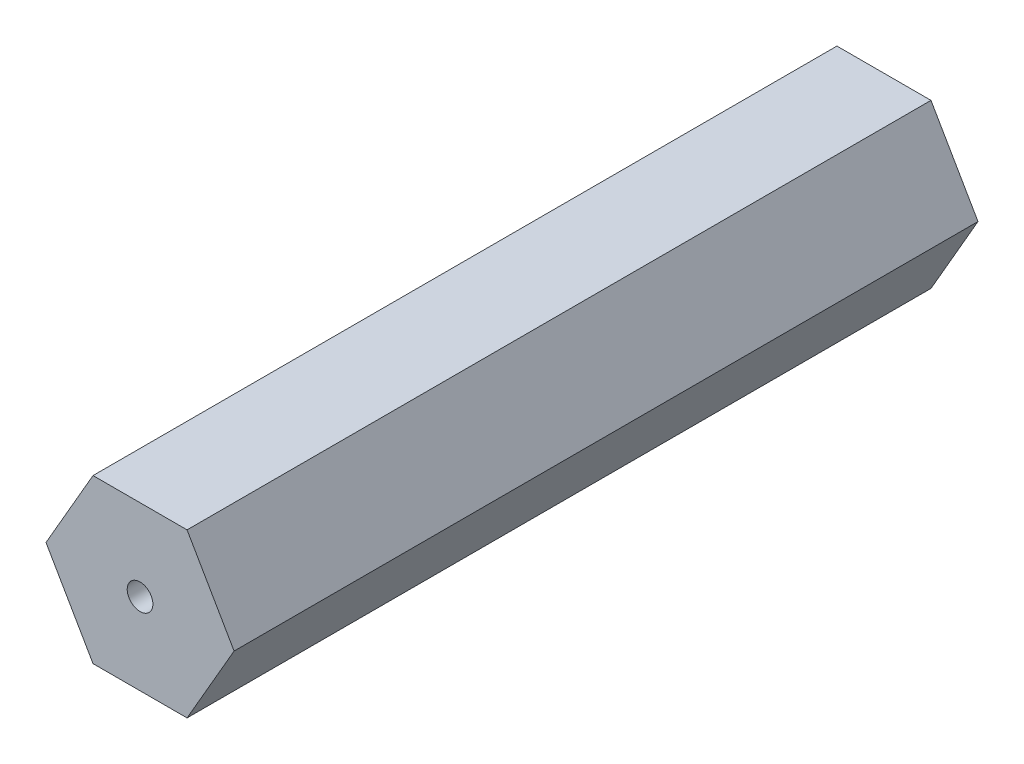
ISO-10303-21;
HEADER;
FILE_DESCRIPTION(('STEP AP214'),'2;1');
FILE_NAME('part.step','',(''),(''),'','','');
FILE_SCHEMA(('AUTOMOTIVE_DESIGN { 1 0 10303 214 1 1 1 1 }'));
ENDSEC;
DATA;
#1=APPLICATION_CONTEXT('core data for automotive mechanical design processes');
#2=APPLICATION_PROTOCOL_DEFINITION('international standard','automotive_design',2000,#1);
#3=PRODUCT_CONTEXT('',#1,'mechanical');
#4=PRODUCT('Part','Part','',(#3));
#5=PRODUCT_RELATED_PRODUCT_CATEGORY('part','',(#4));
#6=PRODUCT_DEFINITION_FORMATION('','',#4);
#7=PRODUCT_DEFINITION_CONTEXT('part definition',#1,'design');
#8=PRODUCT_DEFINITION('design','',#6,#7);
#9=PRODUCT_DEFINITION_SHAPE('','',#8);
#10=(LENGTH_UNIT() NAMED_UNIT(*) SI_UNIT(.MILLI.,.METRE.));
#11=(NAMED_UNIT(*) PLANE_ANGLE_UNIT() SI_UNIT($,.RADIAN.));
#12=(NAMED_UNIT(*) SI_UNIT($,.STERADIAN.) SOLID_ANGLE_UNIT());
#13=UNCERTAINTY_MEASURE_WITH_UNIT(LENGTH_MEASURE(1.E-05),#10,'distance_accuracy_value','');
#14=(GEOMETRIC_REPRESENTATION_CONTEXT(3) GLOBAL_UNCERTAINTY_ASSIGNED_CONTEXT((#13)) GLOBAL_UNIT_ASSIGNED_CONTEXT((#10,
#11,#12)) REPRESENTATION_CONTEXT('',''));
#15=CARTESIAN_POINT('',(0.,0.,0.));
#16=DIRECTION('',(0.,0.,1.));
#17=DIRECTION('',(1.,0.,0.));
#18=AXIS2_PLACEMENT_3D('',#15,#16,#17);
#19=CARTESIAN_POINT('',(3.66617420935419,-6.34999999999994,58.));
#20=DIRECTION('',(-0.866025403784441,0.499999999999995,0.));
#21=DIRECTION('',(-0.499999999999995,-0.866025403784442,0.));
#22=AXIS2_PLACEMENT_3D('',#19,#20,#21);
#23=PLANE('',#22);
#24=DIRECTION('',(0.499999999999995,0.866025403784442,0.));
#25=VECTOR('',#24,1.);
#26=CARTESIAN_POINT('',(3.66617420935419,-6.34999999999994,0.));
#27=LINE('',#26,#25);
#28=CARTESIAN_POINT('',(3.66617420935419,-6.34999999999994,0.));
#29=VERTEX_POINT('',#28);
#30=CARTESIAN_POINT('',(7.33234841870822,0.,0.));
#31=VERTEX_POINT('',#30);
#32=EDGE_CURVE('E122',#29,#31,#27,.T.);
#33=ORIENTED_EDGE('',*,*,#32,.T.);
#34=DIRECTION('',(0.,0.,-1.));
#35=VECTOR('',#34,1.);
#36=CARTESIAN_POINT('',(7.33234841870822,0.,58.));
#37=LINE('',#36,#35);
#38=CARTESIAN_POINT('',(7.33234841870822,0.,58.));
#39=VERTEX_POINT('',#38);
#40=EDGE_CURVE('E11',#39,#31,#37,.T.);
#41=ORIENTED_EDGE('',*,*,#40,.F.);
#42=DIRECTION('',(0.499999999999995,0.866025403784442,0.));
#43=VECTOR('',#42,1.);
#44=CARTESIAN_POINT('',(3.66617420935419,-6.34999999999994,58.));
#45=LINE('',#44,#43);
#46=CARTESIAN_POINT('',(3.66617420935419,-6.34999999999994,58.));
#47=VERTEX_POINT('',#46);
#48=EDGE_CURVE('E133',#47,#39,#45,.T.);
#49=ORIENTED_EDGE('',*,*,#48,.F.);
#50=DIRECTION('',(0.,0.,-1.));
#51=VECTOR('',#50,1.);
#52=CARTESIAN_POINT('',(3.66617420935419,-6.34999999999994,58.));
#53=LINE('',#52,#51);
#54=EDGE_CURVE('E118',#47,#29,#53,.T.);
#55=ORIENTED_EDGE('',*,*,#54,.T.);
#56=EDGE_LOOP('',(#33,#41,#49,#55));
#57=FACE_BOUND('',#56,.T.);
#58=ADVANCED_FACE('F38',(#57),#23,.F.);
#59=CARTESIAN_POINT('',(7.33234841870822,0.,58.));
#60=DIRECTION('',(-0.866025403784438,-0.500000000000001,0.));
#61=DIRECTION('',(0.500000000000001,-0.866025403784438,0.));
#62=AXIS2_PLACEMENT_3D('',#59,#60,#61);
#63=PLANE('',#62);
#64=DIRECTION('',(-0.500000000000001,0.866025403784438,0.));
#65=VECTOR('',#64,1.);
#66=CARTESIAN_POINT('',(7.33234841870822,0.,0.));
#67=LINE('',#66,#65);
#68=CARTESIAN_POINT('',(3.6661742093541,6.34999999999999,0.));
#69=VERTEX_POINT('',#68);
#70=EDGE_CURVE('E125',#31,#69,#67,.T.);
#71=ORIENTED_EDGE('',*,*,#70,.T.);
#72=DIRECTION('',(0.,0.,-1.));
#73=VECTOR('',#72,1.);
#74=CARTESIAN_POINT('',(3.6661742093541,6.34999999999999,58.));
#75=LINE('',#74,#73);
#76=CARTESIAN_POINT('',(3.6661742093541,6.34999999999999,58.));
#77=VERTEX_POINT('',#76);
#78=EDGE_CURVE('E46',#77,#69,#75,.T.);
#79=ORIENTED_EDGE('',*,*,#78,.F.);
#80=DIRECTION('',(-0.500000000000001,0.866025403784438,0.));
#81=VECTOR('',#80,1.);
#82=CARTESIAN_POINT('',(7.33234841870822,0.,58.));
#83=LINE('',#82,#81);
#84=EDGE_CURVE('E91',#39,#77,#83,.T.);
#85=ORIENTED_EDGE('',*,*,#84,.F.);
#86=ORIENTED_EDGE('',*,*,#40,.T.);
#87=EDGE_LOOP('',(#71,#79,#85,#86));
#88=FACE_BOUND('',#87,.T.);
#89=ADVANCED_FACE('F158',(#88),#63,.F.);
#90=CARTESIAN_POINT('',(3.6661742093541,6.34999999999999,58.));
#91=DIRECTION('',(0.,-1.,0.));
#92=DIRECTION('',(1.,0.,0.));
#93=AXIS2_PLACEMENT_3D('',#90,#91,#92);
#94=PLANE('',#93);
#95=DIRECTION('',(-1.,0.,0.));
#96=VECTOR('',#95,1.);
#97=CARTESIAN_POINT('',(3.6661742093541,6.34999999999999,0.));
#98=LINE('',#97,#96);
#99=CARTESIAN_POINT('',(-3.66617420935414,6.34999999999996,0.));
#100=VERTEX_POINT('',#99);
#101=EDGE_CURVE('E128',#69,#100,#98,.T.);
#102=ORIENTED_EDGE('',*,*,#101,.T.);
#103=DIRECTION('',(0.,0.,-1.));
#104=VECTOR('',#103,1.);
#105=CARTESIAN_POINT('',(-3.66617420935414,6.34999999999996,58.));
#106=LINE('',#105,#104);
#107=CARTESIAN_POINT('',(-3.66617420935414,6.34999999999996,58.));
#108=VERTEX_POINT('',#107);
#109=EDGE_CURVE('E113',#108,#100,#106,.T.);
#110=ORIENTED_EDGE('',*,*,#109,.F.);
#111=DIRECTION('',(-1.,0.,0.));
#112=VECTOR('',#111,1.);
#113=CARTESIAN_POINT('',(3.6661742093541,6.34999999999999,58.));
#114=LINE('',#113,#112);
#115=EDGE_CURVE('E104',#77,#108,#114,.T.);
#116=ORIENTED_EDGE('',*,*,#115,.F.);
#117=ORIENTED_EDGE('',*,*,#78,.T.);
#118=EDGE_LOOP('',(#102,#110,#116,#117));
#119=FACE_BOUND('',#118,.T.);
#120=ADVANCED_FACE('F139',(#119),#94,.F.);
#121=CARTESIAN_POINT('',(-3.66617420935414,6.34999999999996,58.));
#122=DIRECTION('',(0.866025403784442,-0.499999999999995,0.));
#123=DIRECTION('',(0.499999999999995,0.866025403784442,0.));
#124=AXIS2_PLACEMENT_3D('',#121,#122,#123);
#125=PLANE('',#124);
#126=DIRECTION('',(-0.499999999999995,-0.866025403784441,0.));
#127=VECTOR('',#126,1.);
#128=CARTESIAN_POINT('',(-3.66617420935414,6.34999999999996,0.));
#129=LINE('',#128,#127);
#130=CARTESIAN_POINT('',(-7.33234841870822,0.,0.));
#131=VERTEX_POINT('',#130);
#132=EDGE_CURVE('E112',#100,#131,#129,.T.);
#133=ORIENTED_EDGE('',*,*,#132,.T.);
#134=DIRECTION('',(0.,0.,-1.));
#135=VECTOR('',#134,1.);
#136=CARTESIAN_POINT('',(-7.33234841870822,0.,58.));
#137=LINE('',#136,#135);
#138=CARTESIAN_POINT('',(-7.33234841870822,0.,58.));
#139=VERTEX_POINT('',#138);
#140=EDGE_CURVE('E109',#139,#131,#137,.T.);
#141=ORIENTED_EDGE('',*,*,#140,.F.);
#142=DIRECTION('',(-0.499999999999995,-0.866025403784441,0.));
#143=VECTOR('',#142,1.);
#144=CARTESIAN_POINT('',(-3.66617420935414,6.34999999999996,58.));
#145=LINE('',#144,#143);
#146=EDGE_CURVE('E98',#108,#139,#145,.T.);
#147=ORIENTED_EDGE('',*,*,#146,.F.);
#148=ORIENTED_EDGE('',*,*,#109,.T.);
#149=EDGE_LOOP('',(#133,#141,#147,#148));
#150=FACE_BOUND('',#149,.T.);
#151=ADVANCED_FACE('F110',(#150),#125,.F.);
#152=CARTESIAN_POINT('',(-7.33234841870822,0.,58.));
#153=DIRECTION('',(0.866025403784434,0.500000000000007,0.));
#154=DIRECTION('',(-0.500000000000007,0.866025403784435,0.));
#155=AXIS2_PLACEMENT_3D('',#152,#153,#154);
#156=PLANE('',#155);
#157=DIRECTION('',(0.500000000000007,-0.866025403784434,0.));
#158=VECTOR('',#157,1.);
#159=CARTESIAN_POINT('',(-7.33234841870822,0.,0.));
#160=LINE('',#159,#158);
#161=CARTESIAN_POINT('',(-3.66617420935405,-6.35000000000001,0.));
#162=VERTEX_POINT('',#161);
#163=EDGE_CURVE('E77',#131,#162,#160,.T.);
#164=ORIENTED_EDGE('',*,*,#163,.T.);
#165=DIRECTION('',(0.,0.,-1.));
#166=VECTOR('',#165,1.);
#167=CARTESIAN_POINT('',(-3.66617420935405,-6.35000000000001,58.));
#168=LINE('',#167,#166);
#169=CARTESIAN_POINT('',(-3.66617420935405,-6.35000000000001,58.));
#170=VERTEX_POINT('',#169);
#171=EDGE_CURVE('E114',#170,#162,#168,.T.);
#172=ORIENTED_EDGE('',*,*,#171,.F.);
#173=DIRECTION('',(0.500000000000007,-0.866025403784434,0.));
#174=VECTOR('',#173,1.);
#175=CARTESIAN_POINT('',(-7.33234841870822,0.,58.));
#176=LINE('',#175,#174);
#177=EDGE_CURVE('E102',#139,#170,#176,.T.);
#178=ORIENTED_EDGE('',*,*,#177,.F.);
#179=ORIENTED_EDGE('',*,*,#140,.T.);
#180=EDGE_LOOP('',(#164,#172,#178,#179));
#181=FACE_BOUND('',#180,.T.);
#182=ADVANCED_FACE('F116',(#181),#156,.F.);
#183=CARTESIAN_POINT('',(-3.66617420935405,-6.35000000000001,58.));
#184=DIRECTION('',(0.,1.,0.));
#185=DIRECTION('',(-1.,0.,0.));
#186=AXIS2_PLACEMENT_3D('',#183,#184,#185);
#187=PLANE('',#186);
#188=DIRECTION('',(1.,0.,0.));
#189=VECTOR('',#188,1.);
#190=CARTESIAN_POINT('',(-3.66617420935405,-6.35000000000001,0.));
#191=LINE('',#190,#189);
#192=EDGE_CURVE('E83',#162,#29,#191,.T.);
#193=ORIENTED_EDGE('',*,*,#192,.T.);
#194=ORIENTED_EDGE('',*,*,#54,.F.);
#195=DIRECTION('',(1.,0.,0.));
#196=VECTOR('',#195,1.);
#197=CARTESIAN_POINT('',(-3.66617420935405,-6.35000000000001,58.));
#198=LINE('',#197,#196);
#199=EDGE_CURVE('E54',#170,#47,#198,.T.);
#200=ORIENTED_EDGE('',*,*,#199,.F.);
#201=ORIENTED_EDGE('',*,*,#171,.T.);
#202=EDGE_LOOP('',(#193,#194,#200,#201));
#203=FACE_BOUND('',#202,.T.);
#204=ADVANCED_FACE('F146',(#203),#187,.F.);
#205=CARTESIAN_POINT('',(0.,0.,58.));
#206=DIRECTION('',(0.,0.,1.));
#207=DIRECTION('',(1.,0.,0.));
#208=AXIS2_PLACEMENT_3D('',#205,#206,#207);
#209=PLANE('',#208);
#210=CARTESIAN_POINT('',(0.,0.,58.));
#211=DIRECTION('',(0.,0.,1.));
#212=DIRECTION('',(1.,0.,0.));
#213=AXIS2_PLACEMENT_3D('',#210,#211,#212);
#214=CIRCLE('',#213,1.);
#215=CARTESIAN_POINT('',(1.,0.,58.));
#216=VERTEX_POINT('',#215);
#217=EDGE_CURVE('E241',#216,#216,#214,.T.);
#218=ORIENTED_EDGE('',*,*,#217,.F.);
#219=EDGE_LOOP('',(#218));
#220=FACE_BOUND('',#219,.T.);
#221=ORIENTED_EDGE('',*,*,#48,.T.);
#222=ORIENTED_EDGE('',*,*,#84,.T.);
#223=ORIENTED_EDGE('',*,*,#115,.T.);
#224=ORIENTED_EDGE('',*,*,#146,.T.);
#225=ORIENTED_EDGE('',*,*,#177,.T.);
#226=ORIENTED_EDGE('',*,*,#199,.T.);
#227=EDGE_LOOP('',(#221,#222,#223,#224,#225,#226));
#228=FACE_BOUND('',#227,.T.);
#229=ADVANCED_FACE('F100',(#220,#228),#209,.T.);
#230=CARTESIAN_POINT('',(0.,0.,0.));
#231=DIRECTION('',(0.,0.,1.));
#232=DIRECTION('',(1.,0.,0.));
#233=AXIS2_PLACEMENT_3D('',#230,#231,#232);
#234=PLANE('',#233);
#235=CARTESIAN_POINT('',(0.,0.,0.));
#236=DIRECTION('',(0.,0.,1.));
#237=DIRECTION('',(1.,0.,0.));
#238=AXIS2_PLACEMENT_3D('',#235,#236,#237);
#239=CIRCLE('',#238,1.);
#240=CARTESIAN_POINT('',(1.,0.,0.));
#241=VERTEX_POINT('',#240);
#242=EDGE_CURVE('E126',#241,#241,#239,.T.);
#243=ORIENTED_EDGE('',*,*,#242,.T.);
#244=EDGE_LOOP('',(#243));
#245=FACE_BOUND('',#244,.T.);
#246=ORIENTED_EDGE('',*,*,#32,.F.);
#247=ORIENTED_EDGE('',*,*,#192,.F.);
#248=ORIENTED_EDGE('',*,*,#163,.F.);
#249=ORIENTED_EDGE('',*,*,#132,.F.);
#250=ORIENTED_EDGE('',*,*,#101,.F.);
#251=ORIENTED_EDGE('',*,*,#70,.F.);
#252=EDGE_LOOP('',(#246,#247,#248,#249,#250,#251));
#253=FACE_BOUND('',#252,.T.);
#254=ADVANCED_FACE('F142',(#245,#253),#234,.F.);
#255=CARTESIAN_POINT('',(0.,0.,0.));
#256=DIRECTION('',(0.,0.,1.));
#257=DIRECTION('',(1.,0.,0.));
#258=AXIS2_PLACEMENT_3D('',#255,#256,#257);
#259=CYLINDRICAL_SURFACE('',#258,1.);
#260=ORIENTED_EDGE('',*,*,#242,.F.);
#261=EDGE_LOOP('',(#260));
#262=FACE_BOUND('',#261,.T.);
#263=ORIENTED_EDGE('',*,*,#217,.T.);
#264=EDGE_LOOP('',(#263));
#265=FACE_BOUND('',#264,.T.);
#266=ADVANCED_FACE('F219',(#262,#265),#259,.F.);
#267=CLOSED_SHELL('',(#58,#89,#120,#151,#182,#204,#229,#254,#266));
#268=MANIFOLD_SOLID_BREP('B2',#267);
#269=ADVANCED_BREP_SHAPE_REPRESENTATION('',(#18,#268),#14);
#270=SHAPE_DEFINITION_REPRESENTATION(#9,#269);
ENDSEC;
END-ISO-10303-21;
